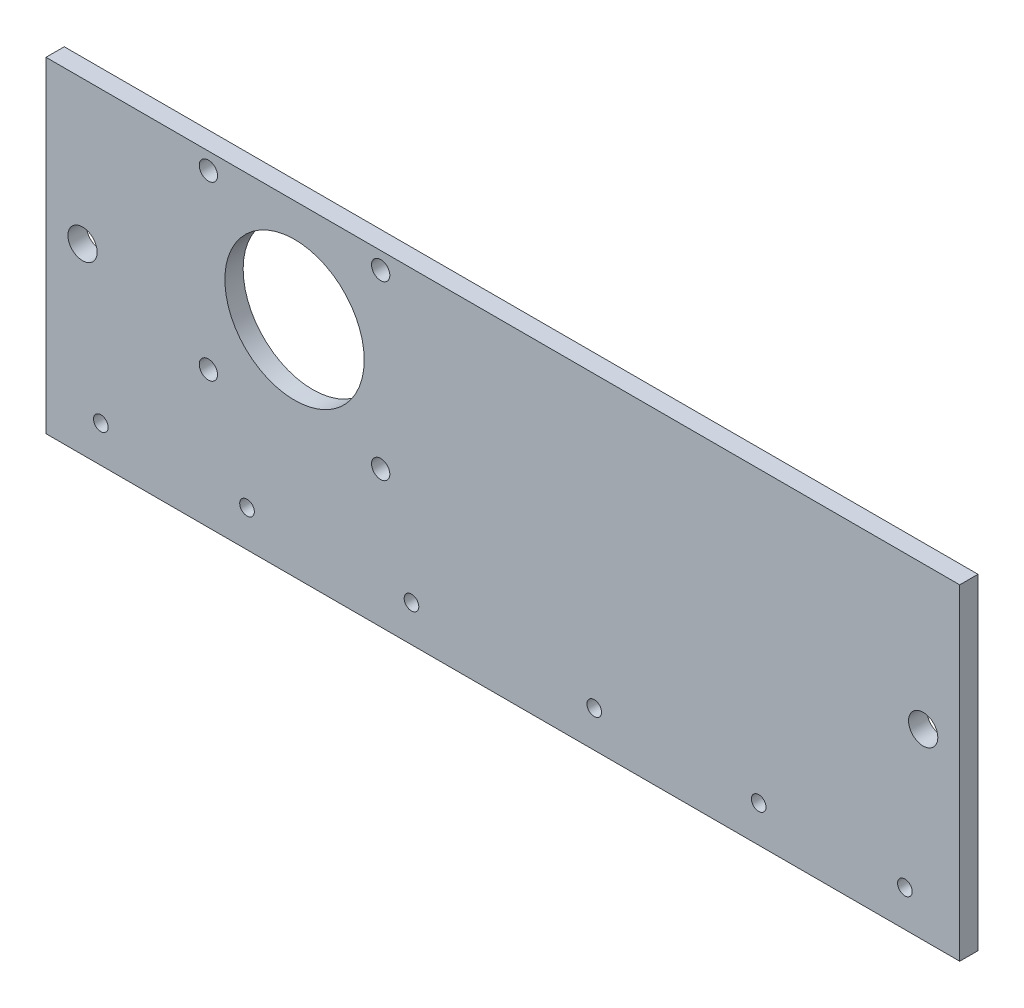
ISO-10303-21;
HEADER;
FILE_DESCRIPTION(('STEP AP214'),'2;1');
FILE_NAME('part.step','',(''),(''),'','','');
FILE_SCHEMA(('AUTOMOTIVE_DESIGN { 1 0 10303 214 1 1 1 1 }'));
ENDSEC;
DATA;
#1=APPLICATION_CONTEXT('core data for automotive mechanical design processes');
#2=APPLICATION_PROTOCOL_DEFINITION('international standard','automotive_design',2000,#1);
#3=PRODUCT_CONTEXT('',#1,'mechanical');
#4=PRODUCT('Part','Part','',(#3));
#5=PRODUCT_RELATED_PRODUCT_CATEGORY('part','',(#4));
#6=PRODUCT_DEFINITION_FORMATION('','',#4);
#7=PRODUCT_DEFINITION_CONTEXT('part definition',#1,'design');
#8=PRODUCT_DEFINITION('design','',#6,#7);
#9=PRODUCT_DEFINITION_SHAPE('','',#8);
#10=(LENGTH_UNIT() NAMED_UNIT(*) SI_UNIT(.MILLI.,.METRE.));
#11=(NAMED_UNIT(*) PLANE_ANGLE_UNIT() SI_UNIT($,.RADIAN.));
#12=(NAMED_UNIT(*) SI_UNIT($,.STERADIAN.) SOLID_ANGLE_UNIT());
#13=UNCERTAINTY_MEASURE_WITH_UNIT(LENGTH_MEASURE(1.E-05),#10,'distance_accuracy_value','');
#14=(GEOMETRIC_REPRESENTATION_CONTEXT(3) GLOBAL_UNCERTAINTY_ASSIGNED_CONTEXT((#13)) GLOBAL_UNIT_ASSIGNED_CONTEXT((#10,
#11,#12)) REPRESENTATION_CONTEXT('',''));
#15=CARTESIAN_POINT('',(0.,0.,0.));
#16=DIRECTION('',(0.,0.,1.));
#17=DIRECTION('',(1.,0.,0.));
#18=AXIS2_PLACEMENT_3D('',#15,#16,#17);
#19=CARTESIAN_POINT('',(0.,0.,-5.));
#20=DIRECTION('',(-1.,0.,0.));
#21=DIRECTION('',(0.,0.,1.));
#22=AXIS2_PLACEMENT_3D('',#19,#20,#21);
#23=PLANE('',#22);
#24=DIRECTION('',(0.,-1.,0.));
#25=VECTOR('',#24,1.);
#26=CARTESIAN_POINT('',(0.,0.,0.));
#27=LINE('',#26,#25);
#28=CARTESIAN_POINT('',(0.,89.2,0.));
#29=VERTEX_POINT('',#28);
#30=CARTESIAN_POINT('',(0.,0.,0.));
#31=VERTEX_POINT('',#30);
#32=EDGE_CURVE('E98',#29,#31,#27,.T.);
#33=ORIENTED_EDGE('',*,*,#32,.F.);
#34=DIRECTION('',(0.,0.,1.));
#35=VECTOR('',#34,1.);
#36=CARTESIAN_POINT('',(0.,89.2,-5.));
#37=LINE('',#36,#35);
#38=CARTESIAN_POINT('',(0.,89.2,-5.));
#39=VERTEX_POINT('',#38);
#40=EDGE_CURVE('E11',#39,#29,#37,.T.);
#41=ORIENTED_EDGE('',*,*,#40,.F.);
#42=DIRECTION('',(0.,-1.,0.));
#43=VECTOR('',#42,1.);
#44=CARTESIAN_POINT('',(0.,0.,-5.));
#45=LINE('',#44,#43);
#46=CARTESIAN_POINT('',(0.,0.,-5.));
#47=VERTEX_POINT('',#46);
#48=EDGE_CURVE('E91',#39,#47,#45,.T.);
#49=ORIENTED_EDGE('',*,*,#48,.T.);
#50=DIRECTION('',(0.,0.,1.));
#51=VECTOR('',#50,1.);
#52=CARTESIAN_POINT('',(0.,0.,-5.));
#53=LINE('',#52,#51);
#54=EDGE_CURVE('E36',#47,#31,#53,.T.);
#55=ORIENTED_EDGE('',*,*,#54,.T.);
#56=EDGE_LOOP('',(#33,#41,#49,#55));
#57=FACE_BOUND('',#56,.T.);
#58=ADVANCED_FACE('F33',(#57),#23,.T.);
#59=CARTESIAN_POINT('',(0.,89.2,-5.));
#60=DIRECTION('',(0.,1.,0.));
#61=DIRECTION('',(0.,0.,1.));
#62=AXIS2_PLACEMENT_3D('',#59,#60,#61);
#63=PLANE('',#62);
#64=DIRECTION('',(-1.,0.,0.));
#65=VECTOR('',#64,1.);
#66=CARTESIAN_POINT('',(0.,89.2,0.));
#67=LINE('',#66,#65);
#68=CARTESIAN_POINT('',(250.,89.2,0.));
#69=VERTEX_POINT('',#68);
#70=EDGE_CURVE('E93',#69,#29,#67,.T.);
#71=ORIENTED_EDGE('',*,*,#70,.F.);
#72=DIRECTION('',(0.,0.,1.));
#73=VECTOR('',#72,1.);
#74=CARTESIAN_POINT('',(250.,89.2,-5.));
#75=LINE('',#74,#73);
#76=CARTESIAN_POINT('',(250.,89.2,-5.));
#77=VERTEX_POINT('',#76);
#78=EDGE_CURVE('E42',#77,#69,#75,.T.);
#79=ORIENTED_EDGE('',*,*,#78,.F.);
#80=DIRECTION('',(-1.,0.,0.));
#81=VECTOR('',#80,1.);
#82=CARTESIAN_POINT('',(0.,89.2,-5.));
#83=LINE('',#82,#81);
#84=EDGE_CURVE('E88',#77,#39,#83,.T.);
#85=ORIENTED_EDGE('',*,*,#84,.T.);
#86=ORIENTED_EDGE('',*,*,#40,.T.);
#87=EDGE_LOOP('',(#71,#79,#85,#86));
#88=FACE_BOUND('',#87,.T.);
#89=ADVANCED_FACE('F109',(#88),#63,.T.);
#90=CARTESIAN_POINT('',(250.,0.,-5.));
#91=DIRECTION('',(1.,0.,0.));
#92=DIRECTION('',(0.,0.,-1.));
#93=AXIS2_PLACEMENT_3D('',#90,#91,#92);
#94=PLANE('',#93);
#95=DIRECTION('',(0.,1.,0.));
#96=VECTOR('',#95,1.);
#97=CARTESIAN_POINT('',(250.,0.,0.));
#98=LINE('',#97,#96);
#99=CARTESIAN_POINT('',(250.,0.,0.));
#100=VERTEX_POINT('',#99);
#101=EDGE_CURVE('E83',#100,#69,#98,.T.);
#102=ORIENTED_EDGE('',*,*,#101,.F.);
#103=DIRECTION('',(0.,0.,1.));
#104=VECTOR('',#103,1.);
#105=CARTESIAN_POINT('',(250.,0.,-5.));
#106=LINE('',#105,#104);
#107=CARTESIAN_POINT('',(250.,0.,-5.));
#108=VERTEX_POINT('',#107);
#109=EDGE_CURVE('E78',#108,#100,#106,.T.);
#110=ORIENTED_EDGE('',*,*,#109,.F.);
#111=DIRECTION('',(0.,1.,0.));
#112=VECTOR('',#111,1.);
#113=CARTESIAN_POINT('',(250.,0.,-5.));
#114=LINE('',#113,#112);
#115=EDGE_CURVE('E81',#108,#77,#114,.T.);
#116=ORIENTED_EDGE('',*,*,#115,.T.);
#117=ORIENTED_EDGE('',*,*,#78,.T.);
#118=EDGE_LOOP('',(#102,#110,#116,#117));
#119=FACE_BOUND('',#118,.T.);
#120=ADVANCED_FACE('F80',(#119),#94,.T.);
#121=CARTESIAN_POINT('',(0.,0.,-5.));
#122=DIRECTION('',(0.,-1.,0.));
#123=DIRECTION('',(0.,0.,-1.));
#124=AXIS2_PLACEMENT_3D('',#121,#122,#123);
#125=PLANE('',#124);
#126=DIRECTION('',(1.,0.,0.));
#127=VECTOR('',#126,1.);
#128=CARTESIAN_POINT('',(0.,0.,0.));
#129=LINE('',#128,#127);
#130=EDGE_CURVE('E101',#31,#100,#129,.T.);
#131=ORIENTED_EDGE('',*,*,#130,.F.);
#132=ORIENTED_EDGE('',*,*,#54,.F.);
#133=DIRECTION('',(1.,0.,0.));
#134=VECTOR('',#133,1.);
#135=CARTESIAN_POINT('',(0.,0.,-5.));
#136=LINE('',#135,#134);
#137=EDGE_CURVE('E87',#47,#108,#136,.T.);
#138=ORIENTED_EDGE('',*,*,#137,.T.);
#139=ORIENTED_EDGE('',*,*,#109,.T.);
#140=EDGE_LOOP('',(#131,#132,#138,#139));
#141=FACE_BOUND('',#140,.T.);
#142=ADVANCED_FACE('F90',(#141),#125,.T.);
#143=CARTESIAN_POINT('',(0.,0.,-5.));
#144=DIRECTION('',(0.,0.,-1.));
#145=DIRECTION('',(-1.,0.,0.));
#146=AXIS2_PLACEMENT_3D('',#143,#144,#145);
#147=PLANE('',#146);
#148=CARTESIAN_POINT('',(100.,9.99999999999999,-5.));
#149=DIRECTION('',(0.,0.,-1.));
#150=DIRECTION('',(-1.,0.,0.));
#151=AXIS2_PLACEMENT_3D('',#148,#149,#150);
#152=CIRCLE('',#151,2.);
#153=CARTESIAN_POINT('',(98.,9.99999999999999,-5.));
#154=VERTEX_POINT('',#153);
#155=EDGE_CURVE('E186',#154,#154,#152,.T.);
#156=ORIENTED_EDGE('',*,*,#155,.F.);
#157=EDGE_LOOP('',(#156));
#158=FACE_BOUND('',#157,.T.);
#159=CARTESIAN_POINT('',(44.43,37.43,-5.));
#160=DIRECTION('',(0.,0.,-1.));
#161=DIRECTION('',(-1.,0.,0.));
#162=AXIS2_PLACEMENT_3D('',#159,#160,#161);
#163=CIRCLE('',#162,2.50000000000001);
#164=CARTESIAN_POINT('',(41.93,37.43,-5.));
#165=VERTEX_POINT('',#164);
#166=EDGE_CURVE('E196',#165,#165,#163,.T.);
#167=ORIENTED_EDGE('',*,*,#166,.F.);
#168=EDGE_LOOP('',(#167));
#169=FACE_BOUND('',#168,.T.);
#170=CARTESIAN_POINT('',(91.57,37.43,-5.));
#171=DIRECTION('',(0.,0.,-1.));
#172=DIRECTION('',(-1.,0.,0.));
#173=AXIS2_PLACEMENT_3D('',#170,#171,#172);
#174=CIRCLE('',#173,2.5);
#175=CARTESIAN_POINT('',(89.07,37.43,-5.));
#176=VERTEX_POINT('',#175);
#177=EDGE_CURVE('E202',#176,#176,#174,.T.);
#178=ORIENTED_EDGE('',*,*,#177,.F.);
#179=EDGE_LOOP('',(#178));
#180=FACE_BOUND('',#179,.T.);
#181=CARTESIAN_POINT('',(91.57,84.57,-5.));
#182=DIRECTION('',(0.,0.,-1.));
#183=DIRECTION('',(-1.,0.,0.));
#184=AXIS2_PLACEMENT_3D('',#181,#182,#183);
#185=CIRCLE('',#184,2.5);
#186=CARTESIAN_POINT('',(89.07,84.57,-5.));
#187=VERTEX_POINT('',#186);
#188=EDGE_CURVE('E208',#187,#187,#185,.T.);
#189=ORIENTED_EDGE('',*,*,#188,.F.);
#190=EDGE_LOOP('',(#189));
#191=FACE_BOUND('',#190,.T.);
#192=CARTESIAN_POINT('',(44.43,84.57,-5.));
#193=DIRECTION('',(0.,0.,-1.));
#194=DIRECTION('',(-1.,0.,0.));
#195=AXIS2_PLACEMENT_3D('',#192,#193,#194);
#196=CIRCLE('',#195,2.50000000000001);
#197=CARTESIAN_POINT('',(41.93,84.57,-5.));
#198=VERTEX_POINT('',#197);
#199=EDGE_CURVE('E214',#198,#198,#196,.T.);
#200=ORIENTED_EDGE('',*,*,#199,.F.);
#201=EDGE_LOOP('',(#200));
#202=FACE_BOUND('',#201,.T.);
#203=CARTESIAN_POINT('',(240.,50.,-5.));
#204=DIRECTION('',(0.,0.,-1.));
#205=DIRECTION('',(-1.,0.,0.));
#206=AXIS2_PLACEMENT_3D('',#203,#204,#205);
#207=CIRCLE('',#206,3.99999999999999);
#208=CARTESIAN_POINT('',(236.,50.,-5.));
#209=VERTEX_POINT('',#208);
#210=EDGE_CURVE('E220',#209,#209,#207,.T.);
#211=ORIENTED_EDGE('',*,*,#210,.F.);
#212=EDGE_LOOP('',(#211));
#213=FACE_BOUND('',#212,.T.);
#214=CARTESIAN_POINT('',(10.,50.,-5.));
#215=DIRECTION('',(0.,0.,-1.));
#216=DIRECTION('',(-1.,0.,0.));
#217=AXIS2_PLACEMENT_3D('',#214,#215,#216);
#218=CIRCLE('',#217,4.);
#219=CARTESIAN_POINT('',(6.,50.,-5.));
#220=VERTEX_POINT('',#219);
#221=EDGE_CURVE('E226',#220,#220,#218,.T.);
#222=ORIENTED_EDGE('',*,*,#221,.F.);
#223=EDGE_LOOP('',(#222));
#224=FACE_BOUND('',#223,.T.);
#225=CARTESIAN_POINT('',(150.,10.,-5.));
#226=DIRECTION('',(0.,0.,-1.));
#227=DIRECTION('',(-1.,0.,0.));
#228=AXIS2_PLACEMENT_3D('',#225,#226,#227);
#229=CIRCLE('',#228,2.);
#230=CARTESIAN_POINT('',(148.,10.,-5.));
#231=VERTEX_POINT('',#230);
#232=EDGE_CURVE('E232',#231,#231,#229,.T.);
#233=ORIENTED_EDGE('',*,*,#232,.F.);
#234=EDGE_LOOP('',(#233));
#235=FACE_BOUND('',#234,.T.);
#236=CARTESIAN_POINT('',(235.,10.,-5.));
#237=DIRECTION('',(0.,0.,-1.));
#238=DIRECTION('',(-1.,0.,0.));
#239=AXIS2_PLACEMENT_3D('',#236,#237,#238);
#240=CIRCLE('',#239,2.);
#241=CARTESIAN_POINT('',(233.,10.,-5.));
#242=VERTEX_POINT('',#241);
#243=EDGE_CURVE('E238',#242,#242,#240,.T.);
#244=ORIENTED_EDGE('',*,*,#243,.F.);
#245=EDGE_LOOP('',(#244));
#246=FACE_BOUND('',#245,.T.);
#247=CARTESIAN_POINT('',(195.,10.,-5.));
#248=DIRECTION('',(0.,0.,-1.));
#249=DIRECTION('',(-1.,0.,0.));
#250=AXIS2_PLACEMENT_3D('',#247,#248,#249);
#251=CIRCLE('',#250,2.);
#252=CARTESIAN_POINT('',(193.,10.,-5.));
#253=VERTEX_POINT('',#252);
#254=EDGE_CURVE('E244',#253,#253,#251,.T.);
#255=ORIENTED_EDGE('',*,*,#254,.F.);
#256=EDGE_LOOP('',(#255));
#257=FACE_BOUND('',#256,.T.);
#258=CARTESIAN_POINT('',(55.,9.99999999999999,-5.));
#259=DIRECTION('',(0.,0.,-1.));
#260=DIRECTION('',(-1.,0.,0.));
#261=AXIS2_PLACEMENT_3D('',#258,#259,#260);
#262=CIRCLE('',#261,2.);
#263=CARTESIAN_POINT('',(53.,9.99999999999999,-5.));
#264=VERTEX_POINT('',#263);
#265=EDGE_CURVE('E250',#264,#264,#262,.T.);
#266=ORIENTED_EDGE('',*,*,#265,.F.);
#267=EDGE_LOOP('',(#266));
#268=FACE_BOUND('',#267,.T.);
#269=CARTESIAN_POINT('',(15.,10.,-5.));
#270=DIRECTION('',(0.,0.,-1.));
#271=DIRECTION('',(-1.,0.,0.));
#272=AXIS2_PLACEMENT_3D('',#269,#270,#271);
#273=CIRCLE('',#272,2.);
#274=CARTESIAN_POINT('',(13.,10.,-5.));
#275=VERTEX_POINT('',#274);
#276=EDGE_CURVE('E256',#275,#275,#273,.T.);
#277=ORIENTED_EDGE('',*,*,#276,.F.);
#278=EDGE_LOOP('',(#277));
#279=FACE_BOUND('',#278,.T.);
#280=CARTESIAN_POINT('',(68.,61.,-5.));
#281=DIRECTION('',(0.,0.,-1.));
#282=DIRECTION('',(-1.,0.,0.));
#283=AXIS2_PLACEMENT_3D('',#280,#281,#282);
#284=CIRCLE('',#283,19.0625);
#285=CARTESIAN_POINT('',(48.9375,61.,-5.));
#286=VERTEX_POINT('',#285);
#287=EDGE_CURVE('E102',#286,#286,#284,.T.);
#288=ORIENTED_EDGE('',*,*,#287,.F.);
#289=EDGE_LOOP('',(#288));
#290=FACE_BOUND('',#289,.T.);
#291=ORIENTED_EDGE('',*,*,#48,.F.);
#292=ORIENTED_EDGE('',*,*,#84,.F.);
#293=ORIENTED_EDGE('',*,*,#115,.F.);
#294=ORIENTED_EDGE('',*,*,#137,.F.);
#295=EDGE_LOOP('',(#291,#292,#293,#294));
#296=FACE_BOUND('',#295,.T.);
#297=ADVANCED_FACE('F86',(#158,#169,#180,#191,#202,#213,#224,#235,#246,#257,#268,#279,#290,
#296),#147,.T.);
#298=CARTESIAN_POINT('',(0.,0.,0.));
#299=DIRECTION('',(0.,0.,-1.));
#300=DIRECTION('',(-1.,0.,0.));
#301=AXIS2_PLACEMENT_3D('',#298,#299,#300);
#302=PLANE('',#301);
#303=CARTESIAN_POINT('',(100.,9.99999999999999,0.));
#304=DIRECTION('',(0.,0.,1.));
#305=DIRECTION('',(1.,0.,0.));
#306=AXIS2_PLACEMENT_3D('',#303,#304,#305);
#307=CIRCLE('',#306,2.);
#308=CARTESIAN_POINT('',(102.,9.99999999999999,0.));
#309=VERTEX_POINT('',#308);
#310=EDGE_CURVE('E189',#309,#309,#307,.T.);
#311=ORIENTED_EDGE('',*,*,#310,.F.);
#312=EDGE_LOOP('',(#311));
#313=FACE_BOUND('',#312,.T.);
#314=CARTESIAN_POINT('',(44.43,37.43,0.));
#315=DIRECTION('',(0.,0.,1.));
#316=DIRECTION('',(1.,0.,0.));
#317=AXIS2_PLACEMENT_3D('',#314,#315,#316);
#318=CIRCLE('',#317,2.50000000000001);
#319=CARTESIAN_POINT('',(46.93,37.43,0.));
#320=VERTEX_POINT('',#319);
#321=EDGE_CURVE('E191',#320,#320,#318,.T.);
#322=ORIENTED_EDGE('',*,*,#321,.F.);
#323=EDGE_LOOP('',(#322));
#324=FACE_BOUND('',#323,.T.);
#325=CARTESIAN_POINT('',(91.57,37.43,0.));
#326=DIRECTION('',(0.,0.,1.));
#327=DIRECTION('',(1.,0.,0.));
#328=AXIS2_PLACEMENT_3D('',#325,#326,#327);
#329=CIRCLE('',#328,2.5);
#330=CARTESIAN_POINT('',(94.07,37.43,0.));
#331=VERTEX_POINT('',#330);
#332=EDGE_CURVE('E199',#331,#331,#329,.T.);
#333=ORIENTED_EDGE('',*,*,#332,.F.);
#334=EDGE_LOOP('',(#333));
#335=FACE_BOUND('',#334,.T.);
#336=CARTESIAN_POINT('',(91.57,84.57,0.));
#337=DIRECTION('',(0.,0.,1.));
#338=DIRECTION('',(1.,0.,0.));
#339=AXIS2_PLACEMENT_3D('',#336,#337,#338);
#340=CIRCLE('',#339,2.5);
#341=CARTESIAN_POINT('',(94.07,84.57,0.));
#342=VERTEX_POINT('',#341);
#343=EDGE_CURVE('E205',#342,#342,#340,.T.);
#344=ORIENTED_EDGE('',*,*,#343,.F.);
#345=EDGE_LOOP('',(#344));
#346=FACE_BOUND('',#345,.T.);
#347=CARTESIAN_POINT('',(44.43,84.57,0.));
#348=DIRECTION('',(0.,0.,1.));
#349=DIRECTION('',(1.,0.,0.));
#350=AXIS2_PLACEMENT_3D('',#347,#348,#349);
#351=CIRCLE('',#350,2.50000000000001);
#352=CARTESIAN_POINT('',(46.93,84.57,0.));
#353=VERTEX_POINT('',#352);
#354=EDGE_CURVE('E211',#353,#353,#351,.T.);
#355=ORIENTED_EDGE('',*,*,#354,.F.);
#356=EDGE_LOOP('',(#355));
#357=FACE_BOUND('',#356,.T.);
#358=CARTESIAN_POINT('',(240.,50.,0.));
#359=DIRECTION('',(0.,0.,1.));
#360=DIRECTION('',(1.,0.,0.));
#361=AXIS2_PLACEMENT_3D('',#358,#359,#360);
#362=CIRCLE('',#361,3.99999999999999);
#363=CARTESIAN_POINT('',(244.,50.,0.));
#364=VERTEX_POINT('',#363);
#365=EDGE_CURVE('E217',#364,#364,#362,.T.);
#366=ORIENTED_EDGE('',*,*,#365,.F.);
#367=EDGE_LOOP('',(#366));
#368=FACE_BOUND('',#367,.T.);
#369=CARTESIAN_POINT('',(10.,50.,0.));
#370=DIRECTION('',(0.,0.,1.));
#371=DIRECTION('',(1.,0.,0.));
#372=AXIS2_PLACEMENT_3D('',#369,#370,#371);
#373=CIRCLE('',#372,4.);
#374=CARTESIAN_POINT('',(14.,50.,0.));
#375=VERTEX_POINT('',#374);
#376=EDGE_CURVE('E223',#375,#375,#373,.T.);
#377=ORIENTED_EDGE('',*,*,#376,.F.);
#378=EDGE_LOOP('',(#377));
#379=FACE_BOUND('',#378,.T.);
#380=CARTESIAN_POINT('',(150.,10.,0.));
#381=DIRECTION('',(0.,0.,1.));
#382=DIRECTION('',(1.,0.,0.));
#383=AXIS2_PLACEMENT_3D('',#380,#381,#382);
#384=CIRCLE('',#383,2.);
#385=CARTESIAN_POINT('',(152.,10.,0.));
#386=VERTEX_POINT('',#385);
#387=EDGE_CURVE('E229',#386,#386,#384,.T.);
#388=ORIENTED_EDGE('',*,*,#387,.F.);
#389=EDGE_LOOP('',(#388));
#390=FACE_BOUND('',#389,.T.);
#391=CARTESIAN_POINT('',(235.,10.,0.));
#392=DIRECTION('',(0.,0.,1.));
#393=DIRECTION('',(1.,0.,0.));
#394=AXIS2_PLACEMENT_3D('',#391,#392,#393);
#395=CIRCLE('',#394,2.);
#396=CARTESIAN_POINT('',(237.,10.,0.));
#397=VERTEX_POINT('',#396);
#398=EDGE_CURVE('E235',#397,#397,#395,.T.);
#399=ORIENTED_EDGE('',*,*,#398,.F.);
#400=EDGE_LOOP('',(#399));
#401=FACE_BOUND('',#400,.T.);
#402=CARTESIAN_POINT('',(195.,10.,0.));
#403=DIRECTION('',(0.,0.,1.));
#404=DIRECTION('',(1.,0.,0.));
#405=AXIS2_PLACEMENT_3D('',#402,#403,#404);
#406=CIRCLE('',#405,2.);
#407=CARTESIAN_POINT('',(197.,10.,0.));
#408=VERTEX_POINT('',#407);
#409=EDGE_CURVE('E241',#408,#408,#406,.T.);
#410=ORIENTED_EDGE('',*,*,#409,.F.);
#411=EDGE_LOOP('',(#410));
#412=FACE_BOUND('',#411,.T.);
#413=CARTESIAN_POINT('',(55.,9.99999999999999,0.));
#414=DIRECTION('',(0.,0.,1.));
#415=DIRECTION('',(1.,0.,0.));
#416=AXIS2_PLACEMENT_3D('',#413,#414,#415);
#417=CIRCLE('',#416,2.);
#418=CARTESIAN_POINT('',(57.,9.99999999999999,0.));
#419=VERTEX_POINT('',#418);
#420=EDGE_CURVE('E247',#419,#419,#417,.T.);
#421=ORIENTED_EDGE('',*,*,#420,.F.);
#422=EDGE_LOOP('',(#421));
#423=FACE_BOUND('',#422,.T.);
#424=CARTESIAN_POINT('',(15.,10.,0.));
#425=DIRECTION('',(0.,0.,1.));
#426=DIRECTION('',(1.,0.,0.));
#427=AXIS2_PLACEMENT_3D('',#424,#425,#426);
#428=CIRCLE('',#427,2.);
#429=CARTESIAN_POINT('',(17.,10.,0.));
#430=VERTEX_POINT('',#429);
#431=EDGE_CURVE('E253',#430,#430,#428,.T.);
#432=ORIENTED_EDGE('',*,*,#431,.F.);
#433=EDGE_LOOP('',(#432));
#434=FACE_BOUND('',#433,.T.);
#435=CARTESIAN_POINT('',(68.,61.,0.));
#436=DIRECTION('',(0.,0.,1.));
#437=DIRECTION('',(1.,0.,0.));
#438=AXIS2_PLACEMENT_3D('',#435,#436,#437);
#439=CIRCLE('',#438,19.0625);
#440=CARTESIAN_POINT('',(87.0625,61.,0.));
#441=VERTEX_POINT('',#440);
#442=EDGE_CURVE('E259',#441,#441,#439,.T.);
#443=ORIENTED_EDGE('',*,*,#442,.F.);
#444=EDGE_LOOP('',(#443));
#445=FACE_BOUND('',#444,.T.);
#446=ORIENTED_EDGE('',*,*,#32,.T.);
#447=ORIENTED_EDGE('',*,*,#130,.T.);
#448=ORIENTED_EDGE('',*,*,#101,.T.);
#449=ORIENTED_EDGE('',*,*,#70,.T.);
#450=EDGE_LOOP('',(#446,#447,#448,#449));
#451=FACE_BOUND('',#450,.T.);
#452=ADVANCED_FACE('F108',(#313,#324,#335,#346,#357,#368,#379,#390,#401,#412,#423,#434,#445,
#451),#302,.F.);
#453=CARTESIAN_POINT('',(68.,61.,-27.));
#454=DIRECTION('',(0.,0.,1.));
#455=DIRECTION('',(1.,0.,0.));
#456=AXIS2_PLACEMENT_3D('',#453,#454,#455);
#457=CYLINDRICAL_SURFACE('',#456,19.0625);
#458=ORIENTED_EDGE('',*,*,#287,.T.);
#459=EDGE_LOOP('',(#458));
#460=FACE_BOUND('',#459,.T.);
#461=ORIENTED_EDGE('',*,*,#442,.T.);
#462=EDGE_LOOP('',(#461));
#463=FACE_BOUND('',#462,.T.);
#464=ADVANCED_FACE('F127',(#460,#463),#457,.F.);
#465=CARTESIAN_POINT('',(15.,10.,-10.));
#466=DIRECTION('',(0.,0.,1.));
#467=DIRECTION('',(1.,0.,0.));
#468=AXIS2_PLACEMENT_3D('',#465,#466,#467);
#469=CYLINDRICAL_SURFACE('',#468,2.);
#470=ORIENTED_EDGE('',*,*,#276,.T.);
#471=EDGE_LOOP('',(#470));
#472=FACE_BOUND('',#471,.T.);
#473=ORIENTED_EDGE('',*,*,#431,.T.);
#474=EDGE_LOOP('',(#473));
#475=FACE_BOUND('',#474,.T.);
#476=ADVANCED_FACE('F134',(#472,#475),#469,.F.);
#477=CARTESIAN_POINT('',(55.,9.99999999999999,-10.));
#478=DIRECTION('',(0.,0.,1.));
#479=DIRECTION('',(1.,0.,0.));
#480=AXIS2_PLACEMENT_3D('',#477,#478,#479);
#481=CYLINDRICAL_SURFACE('',#480,2.);
#482=ORIENTED_EDGE('',*,*,#265,.T.);
#483=EDGE_LOOP('',(#482));
#484=FACE_BOUND('',#483,.T.);
#485=ORIENTED_EDGE('',*,*,#420,.T.);
#486=EDGE_LOOP('',(#485));
#487=FACE_BOUND('',#486,.T.);
#488=ADVANCED_FACE('F138',(#484,#487),#481,.F.);
#489=CARTESIAN_POINT('',(195.,10.,-10.));
#490=DIRECTION('',(0.,0.,1.));
#491=DIRECTION('',(1.,0.,0.));
#492=AXIS2_PLACEMENT_3D('',#489,#490,#491);
#493=CYLINDRICAL_SURFACE('',#492,2.);
#494=ORIENTED_EDGE('',*,*,#254,.T.);
#495=EDGE_LOOP('',(#494));
#496=FACE_BOUND('',#495,.T.);
#497=ORIENTED_EDGE('',*,*,#409,.T.);
#498=EDGE_LOOP('',(#497));
#499=FACE_BOUND('',#498,.T.);
#500=ADVANCED_FACE('F142',(#496,#499),#493,.F.);
#501=CARTESIAN_POINT('',(235.,10.,-10.));
#502=DIRECTION('',(0.,0.,1.));
#503=DIRECTION('',(1.,0.,0.));
#504=AXIS2_PLACEMENT_3D('',#501,#502,#503);
#505=CYLINDRICAL_SURFACE('',#504,2.);
#506=ORIENTED_EDGE('',*,*,#243,.T.);
#507=EDGE_LOOP('',(#506));
#508=FACE_BOUND('',#507,.T.);
#509=ORIENTED_EDGE('',*,*,#398,.T.);
#510=EDGE_LOOP('',(#509));
#511=FACE_BOUND('',#510,.T.);
#512=ADVANCED_FACE('F146',(#508,#511),#505,.F.);
#513=CARTESIAN_POINT('',(150.,10.,-10.));
#514=DIRECTION('',(0.,0.,1.));
#515=DIRECTION('',(1.,0.,0.));
#516=AXIS2_PLACEMENT_3D('',#513,#514,#515);
#517=CYLINDRICAL_SURFACE('',#516,2.);
#518=ORIENTED_EDGE('',*,*,#232,.T.);
#519=EDGE_LOOP('',(#518));
#520=FACE_BOUND('',#519,.T.);
#521=ORIENTED_EDGE('',*,*,#387,.T.);
#522=EDGE_LOOP('',(#521));
#523=FACE_BOUND('',#522,.T.);
#524=ADVANCED_FACE('F150',(#520,#523),#517,.F.);
#525=CARTESIAN_POINT('',(10.,50.,-10.));
#526=DIRECTION('',(0.,0.,1.));
#527=DIRECTION('',(1.,0.,0.));
#528=AXIS2_PLACEMENT_3D('',#525,#526,#527);
#529=CYLINDRICAL_SURFACE('',#528,4.);
#530=ORIENTED_EDGE('',*,*,#221,.T.);
#531=EDGE_LOOP('',(#530));
#532=FACE_BOUND('',#531,.T.);
#533=ORIENTED_EDGE('',*,*,#376,.T.);
#534=EDGE_LOOP('',(#533));
#535=FACE_BOUND('',#534,.T.);
#536=ADVANCED_FACE('F154',(#532,#535),#529,.F.);
#537=CARTESIAN_POINT('',(240.,50.,-10.));
#538=DIRECTION('',(0.,0.,1.));
#539=DIRECTION('',(1.,0.,0.));
#540=AXIS2_PLACEMENT_3D('',#537,#538,#539);
#541=CYLINDRICAL_SURFACE('',#540,3.99999999999999);
#542=ORIENTED_EDGE('',*,*,#210,.T.);
#543=EDGE_LOOP('',(#542));
#544=FACE_BOUND('',#543,.T.);
#545=ORIENTED_EDGE('',*,*,#365,.T.);
#546=EDGE_LOOP('',(#545));
#547=FACE_BOUND('',#546,.T.);
#548=ADVANCED_FACE('F158',(#544,#547),#541,.F.);
#549=CARTESIAN_POINT('',(44.43,84.57,-10.));
#550=DIRECTION('',(0.,0.,1.));
#551=DIRECTION('',(1.,0.,0.));
#552=AXIS2_PLACEMENT_3D('',#549,#550,#551);
#553=CYLINDRICAL_SURFACE('',#552,2.50000000000001);
#554=ORIENTED_EDGE('',*,*,#199,.T.);
#555=EDGE_LOOP('',(#554));
#556=FACE_BOUND('',#555,.T.);
#557=ORIENTED_EDGE('',*,*,#354,.T.);
#558=EDGE_LOOP('',(#557));
#559=FACE_BOUND('',#558,.T.);
#560=ADVANCED_FACE('F162',(#556,#559),#553,.F.);
#561=CARTESIAN_POINT('',(91.57,84.57,-10.));
#562=DIRECTION('',(0.,0.,1.));
#563=DIRECTION('',(1.,0.,0.));
#564=AXIS2_PLACEMENT_3D('',#561,#562,#563);
#565=CYLINDRICAL_SURFACE('',#564,2.5);
#566=ORIENTED_EDGE('',*,*,#188,.T.);
#567=EDGE_LOOP('',(#566));
#568=FACE_BOUND('',#567,.T.);
#569=ORIENTED_EDGE('',*,*,#343,.T.);
#570=EDGE_LOOP('',(#569));
#571=FACE_BOUND('',#570,.T.);
#572=ADVANCED_FACE('F166',(#568,#571),#565,.F.);
#573=CARTESIAN_POINT('',(91.57,37.43,-10.));
#574=DIRECTION('',(0.,0.,1.));
#575=DIRECTION('',(1.,0.,0.));
#576=AXIS2_PLACEMENT_3D('',#573,#574,#575);
#577=CYLINDRICAL_SURFACE('',#576,2.5);
#578=ORIENTED_EDGE('',*,*,#177,.T.);
#579=EDGE_LOOP('',(#578));
#580=FACE_BOUND('',#579,.T.);
#581=ORIENTED_EDGE('',*,*,#332,.T.);
#582=EDGE_LOOP('',(#581));
#583=FACE_BOUND('',#582,.T.);
#584=ADVANCED_FACE('F170',(#580,#583),#577,.F.);
#585=CARTESIAN_POINT('',(44.43,37.43,-10.));
#586=DIRECTION('',(0.,0.,1.));
#587=DIRECTION('',(1.,0.,0.));
#588=AXIS2_PLACEMENT_3D('',#585,#586,#587);
#589=CYLINDRICAL_SURFACE('',#588,2.50000000000001);
#590=ORIENTED_EDGE('',*,*,#166,.T.);
#591=EDGE_LOOP('',(#590));
#592=FACE_BOUND('',#591,.T.);
#593=ORIENTED_EDGE('',*,*,#321,.T.);
#594=EDGE_LOOP('',(#593));
#595=FACE_BOUND('',#594,.T.);
#596=ADVANCED_FACE('F174',(#592,#595),#589,.F.);
#597=CARTESIAN_POINT('',(100.,9.99999999999999,-10.));
#598=DIRECTION('',(0.,0.,1.));
#599=DIRECTION('',(1.,0.,0.));
#600=AXIS2_PLACEMENT_3D('',#597,#598,#599);
#601=CYLINDRICAL_SURFACE('',#600,2.);
#602=ORIENTED_EDGE('',*,*,#155,.T.);
#603=EDGE_LOOP('',(#602));
#604=FACE_BOUND('',#603,.T.);
#605=ORIENTED_EDGE('',*,*,#310,.T.);
#606=EDGE_LOOP('',(#605));
#607=FACE_BOUND('',#606,.T.);
#608=ADVANCED_FACE('F178',(#604,#607),#601,.F.);
#609=CLOSED_SHELL('',(#58,#89,#120,#142,#297,#452,#464,#476,#488,#500,#512,#524,#536,#548,#560,
#572,#584,#596,#608));
#610=MANIFOLD_SOLID_BREP('B2',#609);
#611=ADVANCED_BREP_SHAPE_REPRESENTATION('',(#18,#610),#14);
#612=SHAPE_DEFINITION_REPRESENTATION(#9,#611);
ENDSEC;
END-ISO-10303-21;
